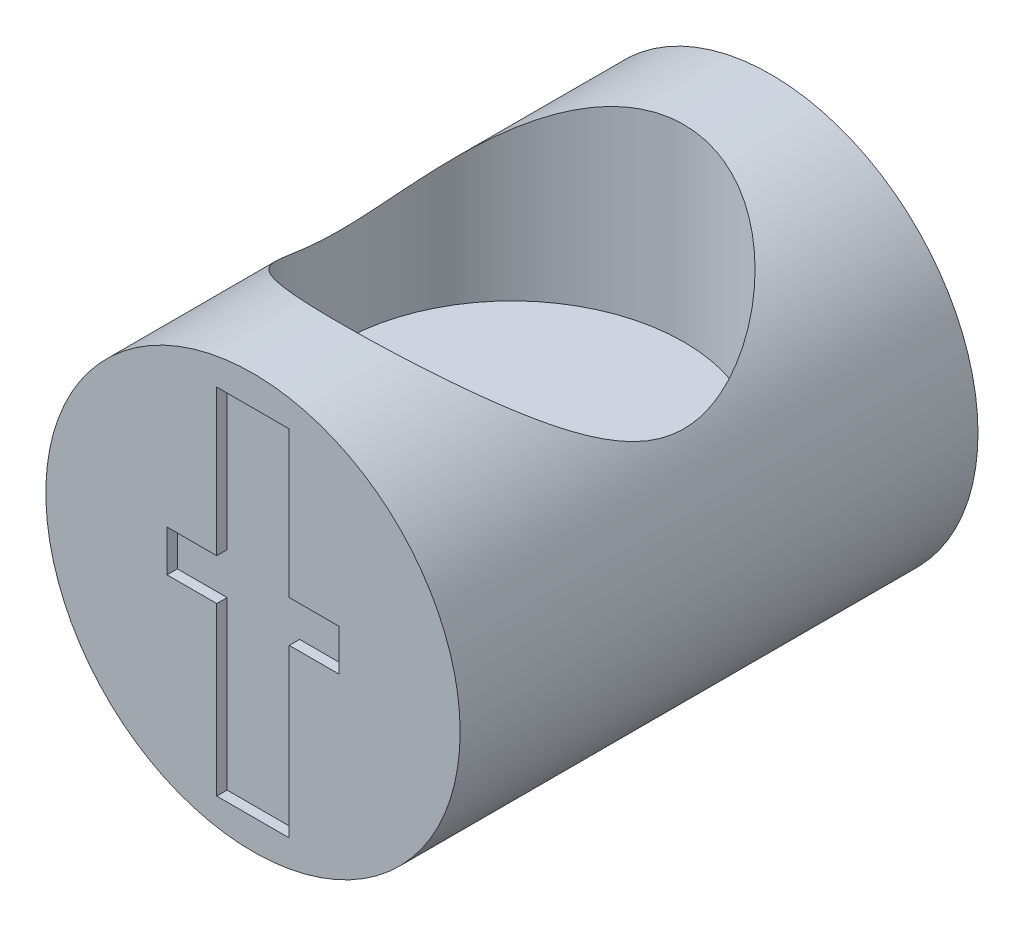
ISO-10303-21;
HEADER;
FILE_DESCRIPTION(('STEP AP214'),'2;1');
FILE_NAME('part.step','',(''),(''),'','','');
FILE_SCHEMA(('AUTOMOTIVE_DESIGN { 1 0 10303 214 1 1 1 1 }'));
ENDSEC;
DATA;
#1=APPLICATION_CONTEXT('core data for automotive mechanical design processes');
#2=APPLICATION_PROTOCOL_DEFINITION('international standard','automotive_design',2000,#1);
#3=PRODUCT_CONTEXT('',#1,'mechanical');
#4=PRODUCT('Part','Part','',(#3));
#5=PRODUCT_RELATED_PRODUCT_CATEGORY('part','',(#4));
#6=PRODUCT_DEFINITION_FORMATION('','',#4);
#7=PRODUCT_DEFINITION_CONTEXT('part definition',#1,'design');
#8=PRODUCT_DEFINITION('design','',#6,#7);
#9=PRODUCT_DEFINITION_SHAPE('','',#8);
#10=(LENGTH_UNIT() NAMED_UNIT(*) SI_UNIT(.MILLI.,.METRE.));
#11=(NAMED_UNIT(*) PLANE_ANGLE_UNIT() SI_UNIT($,.RADIAN.));
#12=(NAMED_UNIT(*) SI_UNIT($,.STERADIAN.) SOLID_ANGLE_UNIT());
#13=UNCERTAINTY_MEASURE_WITH_UNIT(LENGTH_MEASURE(1.E-05),#10,'distance_accuracy_value','');
#14=(GEOMETRIC_REPRESENTATION_CONTEXT(3) GLOBAL_UNCERTAINTY_ASSIGNED_CONTEXT((#13)) GLOBAL_UNIT_ASSIGNED_CONTEXT((#10,
#11,#12)) REPRESENTATION_CONTEXT('',''));
#15=CARTESIAN_POINT('',(0.,0.,0.));
#16=DIRECTION('',(0.,0.,1.));
#17=DIRECTION('',(1.,0.,0.));
#18=AXIS2_PLACEMENT_3D('',#15,#16,#17);
#19=CARTESIAN_POINT('',(0.,0.,50.));
#20=DIRECTION('',(0.,0.,-1.));
#21=DIRECTION('',(-1.,0.,0.));
#22=AXIS2_PLACEMENT_3D('',#19,#20,#21);
#23=CYLINDRICAL_SURFACE('',#22,20.);
#24=CARTESIAN_POINT('',(0.,0.,0.));
#25=DIRECTION('',(0.,0.,1.));
#26=DIRECTION('',(1.,0.,0.));
#27=AXIS2_PLACEMENT_3D('',#24,#25,#26);
#28=CIRCLE('',#27,20.);
#29=CARTESIAN_POINT('',(20.,0.,0.));
#30=VERTEX_POINT('',#29);
#31=EDGE_CURVE('E47',#30,#30,#28,.T.);
#32=ORIENTED_EDGE('',*,*,#31,.T.);
#33=EDGE_LOOP('',(#32));
#34=FACE_BOUND('',#33,.T.);
#35=CARTESIAN_POINT('',(0.,0.,50.));
#36=DIRECTION('',(0.,0.,1.));
#37=DIRECTION('',(1.,0.,0.));
#38=AXIS2_PLACEMENT_3D('',#35,#36,#37);
#39=CIRCLE('',#38,20.);
#40=CARTESIAN_POINT('',(20.,0.,50.));
#41=VERTEX_POINT('',#40);
#42=EDGE_CURVE('E12',#41,#41,#39,.T.);
#43=ORIENTED_EDGE('',*,*,#42,.F.);
#44=EDGE_LOOP('',(#43));
#45=FACE_BOUND('',#44,.T.);
#46=CARTESIAN_POINT('',(0.,20.,8.4));
#47=CARTESIAN_POINT('',(-0.394698975178942,19.9999966452955,8.40000344858247));
#48=CARTESIAN_POINT('',(-0.789456896835808,19.9882896222115,8.41410314964542));
#49=CARTESIAN_POINT('',(-1.57564079967477,19.9417280702438,8.47024627668804));
#50=CARTESIAN_POINT('',(-1.96706609388417,19.906868880539,8.51229532922352));
#51=CARTESIAN_POINT('',(-2.74367709559666,19.8147738184122,8.6236072588081));
#52=CARTESIAN_POINT('',(-3.12885736798368,19.7575194407535,8.69289264158653));
#53=CARTESIAN_POINT('',(-3.88978006494809,19.6219006741202,8.85747363807984));
#54=CARTESIAN_POINT('',(-4.2655227496847,19.5435368677538,8.95276853394791));
#55=CARTESIAN_POINT('',(-5.00291695065156,19.367850034973,9.1672058879828));
#56=CARTESIAN_POINT('',(-5.36464088457492,19.2706465054858,9.28619816247414));
#57=CARTESIAN_POINT('',(-6.07454277499892,19.0587818388318,9.54675069048557));
#58=CARTESIAN_POINT('',(-6.4227209251517,18.9441209513527,9.68831062122817));
#59=CARTESIAN_POINT('',(-7.1041479495527,18.6992558693516,9.9923256247644));
#60=CARTESIAN_POINT('',(-7.43739621930377,18.5690510462508,10.1547815425883));
#61=CARTESIAN_POINT('',(-8.08799902961266,18.2950521218716,10.4989733417761));
#62=CARTESIAN_POINT('',(-8.40535018510503,18.1512551449972,10.6807133039305));
#63=CARTESIAN_POINT('',(-9.13648703831569,17.7973145066341,11.1316731189351));
#64=CARTESIAN_POINT('',(-9.54311598559062,17.5821334531887,11.4085853208185));
#65=CARTESIAN_POINT('',(-10.324527144532,17.1349625737068,11.9922275382119));
#66=CARTESIAN_POINT('',(-10.6992985482179,16.9029670922738,12.2989675980436));
#67=CARTESIAN_POINT('',(-11.4174814756029,16.4264199766707,12.9404176494795));
#68=CARTESIAN_POINT('',(-11.7608111044915,16.1818380072213,13.2751965650625));
#69=CARTESIAN_POINT('',(-12.4149233254186,15.6856040738851,13.970158529579));
#70=CARTESIAN_POINT('',(-12.725709975507,15.4339529964785,14.3303384016634));
#71=CARTESIAN_POINT('',(-13.3200885765811,14.9241830683603,15.0818872243909));
#72=CARTESIAN_POINT('',(-13.6030854602694,14.6660296650628,15.47370318306));
#73=CARTESIAN_POINT('',(-14.1351355630712,14.1539476860419,16.2826377947297));
#74=CARTESIAN_POINT('',(-14.384177436292,13.9000205472644,16.6997648383487));
#75=CARTESIAN_POINT('',(-14.8467527251474,13.4047908015893,17.5588018456537));
#76=CARTESIAN_POINT('',(-15.0603711353158,13.1634589568698,18.0006489833835));
#77=CARTESIAN_POINT('',(-15.4509004794417,12.7027797493219,18.9111003755087));
#78=CARTESIAN_POINT('',(-15.6278428086437,12.4834136673457,19.3796813034977));
#79=CARTESIAN_POINT('',(-15.8711702504126,12.1706970339188,20.1272522082387));
#80=CARTESIAN_POINT('',(-15.9514674651853,12.065072599039,20.3966331860104));
#81=CARTESIAN_POINT('',(-16.0992947385688,11.8670949201531,20.9437685462009));
#82=CARTESIAN_POINT('',(-16.1668231498086,11.774743388923,21.2215240037034));
#83=CARTESIAN_POINT('',(-16.288097348558,11.6064057566701,21.7843258788794));
#84=CARTESIAN_POINT('',(-16.3418701359091,11.5303876437643,22.0693567870689));
#85=CARTESIAN_POINT('',(-16.4348497840015,11.3974694594378,22.6460778238326));
#86=CARTESIAN_POINT('',(-16.474064295884,11.3405593472634,22.9377643687135));
#87=CARTESIAN_POINT('',(-16.5374880628783,11.2478760164267,23.5298959865168));
#88=CARTESIAN_POINT('',(-16.5615052808192,11.2123735644049,23.8304048099599));
#89=CARTESIAN_POINT('',(-16.5931065604945,11.1655555991343,24.4341662355413));
#90=CARTESIAN_POINT('',(-16.6006920666786,11.1542379598912,24.7374185941522));
#91=CARTESIAN_POINT('',(-16.5992085305302,11.1564455871342,25.3438238564076));
#92=CARTESIAN_POINT('',(-16.5901377585454,11.1699734336718,25.6469767464534));
#93=CARTESIAN_POINT('',(-16.5556062846334,11.2210884432127,26.2502980980598));
#94=CARTESIAN_POINT('',(-16.5301435297562,11.2586786198055,26.5504661810178));
#95=CARTESIAN_POINT('',(-16.4604450708369,11.3603640236142,27.1726801363264));
#96=CARTESIAN_POINT('',(-16.4147019784234,11.4265737035129,27.4942080687945));
#97=CARTESIAN_POINT('',(-16.3056788050547,11.5816135650179,28.1286632094567));
#98=CARTESIAN_POINT('',(-16.2423958314527,11.6704474775772,28.4415889896339));
#99=CARTESIAN_POINT('',(-16.0993601883099,11.8669869085656,29.0584655702652));
#100=CARTESIAN_POINT('',(-16.0195644583316,11.9747416534152,29.3623904816459));
#101=CARTESIAN_POINT('',(-15.8447071081248,12.2051714474301,29.9600661455018));
#102=CARTESIAN_POINT('',(-15.7496395530383,12.3278522925843,30.2538128884175));
#103=CARTESIAN_POINT('',(-15.4858937915915,12.6591512677654,30.9984337036137));
#104=CARTESIAN_POINT('',(-15.3064866099024,12.8763670559824,31.4417029896371));
#105=CARTESIAN_POINT('',(-14.9143774562329,13.3285823867856,32.3038190167309));
#106=CARTESIAN_POINT('',(-14.7016563866963,13.5635920897677,32.7226515589624));
#107=CARTESIAN_POINT('',(-14.2440404064059,14.0434113232034,33.5373188400374));
#108=CARTESIAN_POINT('',(-13.9991027814053,14.2882335585857,33.9331220225433));
#109=CARTESIAN_POINT('',(-13.4780009593977,14.7808009978415,34.7014901291365));
#110=CARTESIAN_POINT('',(-13.2018429153143,15.0285456171811,35.0740596097446));
#111=CARTESIAN_POINT('',(-12.6041241474354,15.5337255427375,35.8135583168986));
#112=CARTESIAN_POINT('',(-12.2809985427826,15.7910382939333,36.1793092341155));
#113=CARTESIAN_POINT('',(-11.6005531108339,16.2974563832508,36.8838971910137));
#114=CARTESIAN_POINT('',(-11.2432281760522,16.5465604879641,37.2227301967784));
#115=CARTESIAN_POINT('',(-10.4952493751045,17.0307919149643,37.870667236314));
#116=CARTESIAN_POINT('',(-10.1046614013938,17.265945373265,38.1798275786088));
#117=CARTESIAN_POINT('',(-9.2900878421043,17.7175321823896,38.7661127818517));
#118=CARTESIAN_POINT('',(-8.8661141617731,17.9339721491455,39.0432489763121));
#119=CARTESIAN_POINT('',(-8.0966615998196,18.2914205342511,39.4965603183188));
#120=CARTESIAN_POINT('',(-7.75824795778765,18.437712303454,39.680600705969));
#121=CARTESIAN_POINT('',(-7.06428773000994,18.7145747838767,40.0268467746843));
#122=CARTESIAN_POINT('',(-6.70874525801631,18.8451492437545,40.1890576632893));
#123=CARTESIAN_POINT('',(-5.98192839077866,19.0883030427185,40.4897102776646));
#124=CARTESIAN_POINT('',(-5.61065976667816,19.2008889120588,40.6281606303911));
#125=CARTESIAN_POINT('',(-4.85410153741345,19.4059598436715,40.879437990384));
#126=CARTESIAN_POINT('',(-4.46881168877932,19.4984445567051,40.9922645524626));
#127=CARTESIAN_POINT('',(-3.68370789405272,19.6619491195484,41.1912161961806));
#128=CARTESIAN_POINT('',(-3.28380693393771,19.7328034177983,41.2771354619225));
#129=CARTESIAN_POINT('',(-2.47527956295057,19.8504370094547,41.4195451451607));
#130=CARTESIAN_POINT('',(-2.06665313830461,19.897216264854,41.4760355161978));
#131=CARTESIAN_POINT('',(-1.24441650480821,19.9655084019545,41.558443711741));
#132=CARTESIAN_POINT('',(-0.830808746741599,19.9870332337292,41.5843759959723));
#133=CARTESIAN_POINT('',(-0.00229538460336004,20.0042900441552,41.6051696097669));
#134=CARTESIAN_POINT('',(0.412610084210983,20.0000246268366,41.6000340762341));
#135=CARTESIAN_POINT('',(1.19195573041446,19.967807858522,41.561202911586));
#136=CARTESIAN_POINT('',(1.5566874494046,19.9426503610818,41.5308759598272));
#137=CARTESIAN_POINT('',(2.28146982597581,19.8727806768232,41.4465185511675));
#138=CARTESIAN_POINT('',(2.64152091349246,19.8280702992752,41.392490287399));
#139=CARTESIAN_POINT('',(3.35458568211295,19.7199600654026,41.2615554913025));
#140=CARTESIAN_POINT('',(3.70759890731723,19.656559002503,41.1846474819722));
#141=CARTESIAN_POINT('',(4.40449517307662,19.5122286942472,41.0090464600545));
#142=CARTESIAN_POINT('',(4.74837774868425,19.4312985581964,40.9103523404573));
#143=CARTESIAN_POINT('',(5.43172944764431,19.2515847700464,40.6903670191165));
#144=CARTESIAN_POINT('',(5.77098872020586,19.1524895540864,40.5686801082442));
#145=CARTESIAN_POINT('',(6.43674143192144,18.9391279559672,40.3054405194323));
#146=CARTESIAN_POINT('',(6.76323509227053,18.8248618368314,40.1638881859043));
#147=CARTESIAN_POINT('',(7.40242695050028,18.5828114257006,39.8623340030078));
#148=CARTESIAN_POINT('',(7.71512331243304,18.4550253423025,39.7023297084904));
#149=CARTESIAN_POINT('',(8.32594563381835,18.1876288612729,39.3652485717753));
#150=CARTESIAN_POINT('',(8.62406866021638,18.0480160987099,39.1881683139845));
#151=CARTESIAN_POINT('',(9.33631559156132,17.6933601482723,38.7347385018059));
#152=CARTESIAN_POINT('',(9.74211191124159,17.4726970173606,38.4496389549776));
#153=CARTESIAN_POINT('',(10.5210805171552,17.0150259100496,37.849468116245));
#154=CARTESIAN_POINT('',(10.8942401050414,16.7780116353165,37.5343852570716));
#155=CARTESIAN_POINT('',(11.6086373974721,16.2919219229195,36.8758688651232));
#156=CARTESIAN_POINT('',(11.9497751747551,16.042812184949,36.5323524942863));
#157=CARTESIAN_POINT('',(12.5987479391492,15.5383532930442,35.8196052034116));
#158=CARTESIAN_POINT('',(12.9065877507607,15.283005049589,35.4503780213579));
#159=CARTESIAN_POINT('',(13.4941094832925,14.7670071037832,34.68027670398));
#160=CARTESIAN_POINT('',(13.7731967723363,14.5063435439594,34.2789581907265));
#161=CARTESIAN_POINT('',(14.2965626470142,13.9908248458607,33.4503566921983));
#162=CARTESIAN_POINT('',(14.5408276617343,13.7359720044627,33.0230636761899));
#163=CARTESIAN_POINT('',(14.9926268634756,13.2413344807694,32.1431838965802));
#164=CARTESIAN_POINT('',(15.2002719299633,13.0015057810003,31.6906791432905));
#165=CARTESIAN_POINT('',(15.5774543224708,12.5471060621683,30.7580785210586));
#166=CARTESIAN_POINT('',(15.7470300796134,12.3325096761905,30.2780110973235));
#167=CARTESIAN_POINT('',(15.9750512441224,12.0339090979649,29.52033648862));
#168=CARTESIAN_POINT('',(16.0484335287304,11.9356875134222,29.2527652400832));
#169=CARTESIAN_POINT('',(16.182572795463,11.7531755100396,28.7097865705206));
#170=CARTESIAN_POINT('',(16.2433316006212,11.6688830799661,28.4343802875401));
#171=CARTESIAN_POINT('',(16.3512560663958,11.5171656287826,27.8769472494994));
#172=CARTESIAN_POINT('',(16.3984502841117,11.4497052118771,27.5949357750476));
#173=CARTESIAN_POINT('',(16.4785365523849,11.3341429406444,27.0249924253388));
#174=CARTESIAN_POINT('',(16.511432214988,11.2860361974959,26.7370620645583));
#175=CARTESIAN_POINT('',(16.5624528955225,11.2110330456974,26.1539814371535));
#176=CARTESIAN_POINT('',(16.5804177157702,11.1843667751359,25.8587869962432));
#177=CARTESIAN_POINT('',(16.6005005101624,11.1545379805242,25.2666754357459));
#178=CARTESIAN_POINT('',(16.602619530299,11.151373905078,24.9697584311614));
#179=CARTESIAN_POINT('',(16.5909487327652,11.1687297227833,24.3767693066185));
#180=CARTESIAN_POINT('',(16.5771497159342,11.189263311007,24.0806977744335));
#181=CARTESIAN_POINT('',(16.5340102231995,11.2529087668619,23.4921459677016));
#182=CARTESIAN_POINT('',(16.5046674942053,11.2960239077217,23.199666220081));
#183=CARTESIAN_POINT('',(16.4257496288291,11.4105327655461,22.57783864895));
#184=CARTESIAN_POINT('',(16.3738359218532,11.4851497061378,22.2493849604407));
#185=CARTESIAN_POINT('',(16.2518374557661,11.6571370574015,21.602002456089));
#186=CARTESIAN_POINT('',(16.1817486532031,11.754512530736,21.2830757773702));
#187=CARTESIAN_POINT('',(16.0245371718655,11.9679484146517,20.6549670053178));
#188=CARTESIAN_POINT('',(15.9373709504998,12.0840564515218,20.3458122180959));
#189=CARTESIAN_POINT('',(15.7472483260178,12.330793565144,19.738296428837));
#190=CARTESIAN_POINT('',(15.6442858590076,12.4614282130781,19.4399396265438));
#191=CARTESIAN_POINT('',(15.3594114039098,12.812687481983,18.6838705554844));
#192=CARTESIAN_POINT('',(15.1663575756821,13.0415420838561,18.2341560973505));
#193=CARTESIAN_POINT('',(14.7454983158529,13.5155827107875,17.3602589708177));
#194=CARTESIAN_POINT('',(14.5176734799581,13.7607778115065,16.9360907442194));
#195=CARTESIAN_POINT('',(14.0282495241585,14.2593984929394,16.1119099623764));
#196=CARTESIAN_POINT('',(13.766606674946,14.512834406432,15.7119296845234));
#197=CARTESIAN_POINT('',(13.210395505564,15.0208980594888,14.9365496161379));
#198=CARTESIAN_POINT('',(12.9158336863865,15.2755255542509,14.5611449954298));
#199=CARTESIAN_POINT('',(12.2809719715334,15.7908752702281,13.820312661746));
#200=CARTESIAN_POINT('',(11.9392822138208,16.0514125669414,13.4559436798966));
#201=CARTESIAN_POINT('',(11.2202800771209,16.5619999277011,12.7559358709636));
#202=CARTESIAN_POINT('',(10.8429617720012,16.8120482370788,12.4203018411582));
#203=CARTESIAN_POINT('',(10.053652082582,17.2955979861789,11.781025107175));
#204=CARTESIAN_POINT('',(9.64173446698326,17.5291327685408,11.4773172993957));
#205=CARTESIAN_POINT('',(8.99822815709248,17.8630997276374,11.0479977624389));
#206=CARTESIAN_POINT('',(8.77948476596258,17.9716863445845,10.9092814142434));
#207=CARTESIAN_POINT('',(8.33350403545557,18.1827824563872,10.6410153485498));
#208=CARTESIAN_POINT('',(8.10626468836991,18.285290499804,10.5114678189598));
#209=CARTESIAN_POINT('',(7.54306598052021,18.5265333384429,10.2079676392106));
#210=CARTESIAN_POINT('',(7.20275136534879,18.661666252225,10.0391652290448));
#211=CARTESIAN_POINT('',(6.50637097178844,18.9157200959421,9.72344128604715));
#212=CARTESIAN_POINT('',(6.15030905323539,19.0346449697937,9.57651442941045));
#213=CARTESIAN_POINT('',(5.42429798603642,19.2541062785101,9.30647298638667));
#214=CARTESIAN_POINT('',(5.05436729616162,19.3546661775928,9.18332800308948));
#215=CARTESIAN_POINT('',(4.30221136208994,19.535620988391,8.96240327433902));
#216=CARTESIAN_POINT('',(3.91998864835085,19.616020020855,8.86461834531738));
#217=CARTESIAN_POINT('',(3.24594576205722,19.7369935382418,8.71779633995303));
#218=CARTESIAN_POINT('',(2.95630983659309,19.7824900232818,8.66269236156212));
#219=CARTESIAN_POINT('',(2.3727871498738,19.8609296740836,8.56779855907284));
#220=CARTESIAN_POINT('',(2.07889972130268,19.8938708464787,8.5280111667297));
#221=CARTESIAN_POINT('',(1.48820811515359,19.9467584367588,8.46417549030524));
#222=CARTESIAN_POINT('',(1.19140350731088,19.9667029076095,8.44012956444861));
#223=CARTESIAN_POINT('',(0.5964102927649,19.9933236415208,8.40804210273354));
#224=CARTESIAN_POINT('',(0.298221972160024,20.0000025347079,8.39999739436095));
#225=CARTESIAN_POINT('',(0.,20.,8.4));
#226=B_SPLINE_CURVE_WITH_KNOTS('',3,(#46,#47,#48,#49,#50,#51,#52,#53,#54,#55,#56,#57,#58,#59,
#60,#61,#62,#63,#64,#65,#66,#67,#68,#69,#70,#71,#72,#73,#74,#75,#76,#77,#78,#79,#80,#81,#82,#83,
#84,#85,#86,#87,#88,#89,#90,#91,#92,#93,#94,#95,#96,#97,#98,#99,#100,#101,#102,#103,#104,#105,
#106,#107,#108,#109,#110,#111,#112,#113,#114,#115,#116,#117,#118,#119,#120,#121,#122,#123,#124,
#125,#126,#127,#128,#129,#130,#131,#132,#133,#134,#135,#136,#137,#138,#139,#140,#141,#142,#143,
#144,#145,#146,#147,#148,#149,#150,#151,#152,#153,#154,#155,#156,#157,#158,#159,#160,#161,#162,
#163,#164,#165,#166,#167,#168,#169,#170,#171,#172,#173,#174,#175,#176,#177,#178,#179,#180,#181,
#182,#183,#184,#185,#186,#187,#188,#189,#190,#191,#192,#193,#194,#195,#196,#197,#198,#199,#200,
#201,#202,#203,#204,#205,#206,#207,#208,#209,#210,#211,#212,#213,#214,#215,#216,#217,#218,#219,
#220,#221,#222,#223,#224,#225),.UNSPECIFIED.,.T.,.F.,(4,2,2,2,2,2,2,2,2,2,2,2,2,2,2,2,2,2,2,2,2,
2,2,2,2,2,2,2,2,2,2,2,2,2,2,2,2,2,2,2,2,2,2,2,2,2,2,2,2,2,2,2,2,2,2,2,2,2,2,2,2,2,2,2,2,2,2,2,2,
2,2,2,2,2,2,2,2,2,2,2,2,2,2,2,2,2,2,2,2,4),(0.,1.18377821646862,2.36779481457974,
3.55279184433443,4.73775617219572,5.91543690634163,7.09310079803276,8.27081232923986,
9.44877358063308,11.0573540075558,12.6664780009031,14.2796805986125,15.892681792748,
17.5349213639497,19.1777083432354,20.8164947499058,22.4538724853993,23.3541673006508,
24.2545781885762,25.1532079294993,26.0513647223015,26.960655419397,27.8698661809379,
28.7791713637815,29.6885904511751,30.6814047157584,31.6743828110731,32.669983691509,
33.665972417394,35.2392124928611,36.8133577694393,38.389611566972,39.9655552560079,
41.6189963313798,43.2726847257351,44.9231702285064,46.5730698152261,47.8081495575917,
49.0429341410323,50.2772694470127,51.5116261967013,52.7552062009203,53.9987881683716,
55.2417814509531,56.4846492311462,57.583903996514,58.6830570669664,59.7822811086602,
60.8815610176911,62.0018435644761,63.1221066910505,64.2425184394781,65.363154763244,
66.9892380806723,68.6159512882408,70.247582872212,71.8789777335772,73.5392396819486,
75.2001469079799,76.8559354413715,78.5100448569611,79.3924429228538,80.2747134675612,
81.1551127579978,82.0352895159328,82.9247923175245,83.8142364019034,84.7041947607424,
85.5942821560406,86.615095381729,87.6361359050222,88.6598144933648,89.6838870413173,
91.3022327486835,92.9214849141376,94.5428522464839,96.1638999475773,97.8521481489541,
99.5406776546793,101.225694261199,102.067981720174,102.910469496925,104.118856932032,
105.326949802175,106.533488172123,107.739779732186,108.634106330418,109.528574858929,
110.423177356875,111.317602466936),.UNSPECIFIED.);
#227=CARTESIAN_POINT('',(0.,20.,8.4));
#228=VERTEX_POINT('',#227);
#229=EDGE_CURVE('E39',#228,#228,#226,.T.);
#230=ORIENTED_EDGE('',*,*,#229,.F.);
#231=EDGE_LOOP('',(#230));
#232=FACE_BOUND('',#231,.T.);
#233=ADVANCED_FACE('F35',(#34,#45,#232),#23,.T.);
#234=CARTESIAN_POINT('',(0.,0.,50.));
#235=DIRECTION('',(0.,0.,1.));
#236=DIRECTION('',(1.,0.,0.));
#237=AXIS2_PLACEMENT_3D('',#234,#235,#236);
#238=PLANE('',#237);
#239=DIRECTION('',(0.,1.,0.));
#240=VECTOR('',#239,1.);
#241=CARTESIAN_POINT('',(8.3,1.,50.));
#242=LINE('',#241,#240);
#243=CARTESIAN_POINT('',(8.3,-1.,50.));
#244=VERTEX_POINT('',#243);
#245=CARTESIAN_POINT('',(8.3,3.,50.));
#246=VERTEX_POINT('',#245);
#247=EDGE_CURVE('E193',#244,#246,#242,.T.);
#248=ORIENTED_EDGE('',*,*,#247,.F.);
#249=DIRECTION('',(1.,0.,0.));
#250=VECTOR('',#249,1.);
#251=CARTESIAN_POINT('',(3.5,-1.,50.));
#252=LINE('',#251,#250);
#253=CARTESIAN_POINT('',(3.5,-1.,50.));
#254=VERTEX_POINT('',#253);
#255=EDGE_CURVE('E191',#254,#244,#252,.T.);
#256=ORIENTED_EDGE('',*,*,#255,.F.);
#257=DIRECTION('',(0.,1.,0.));
#258=VECTOR('',#257,1.);
#259=CARTESIAN_POINT('',(3.5,-2.,50.));
#260=LINE('',#259,#258);
#261=CARTESIAN_POINT('',(3.5,-17.1,50.));
#262=VERTEX_POINT('',#261);
#263=EDGE_CURVE('E189',#262,#254,#260,.T.);
#264=ORIENTED_EDGE('',*,*,#263,.F.);
#265=DIRECTION('',(1.,0.,0.));
#266=VECTOR('',#265,1.);
#267=CARTESIAN_POINT('',(-3.5,-17.1,50.));
#268=LINE('',#267,#266);
#269=CARTESIAN_POINT('',(-3.5,-17.1,50.));
#270=VERTEX_POINT('',#269);
#271=EDGE_CURVE('E138',#270,#262,#268,.T.);
#272=ORIENTED_EDGE('',*,*,#271,.F.);
#273=DIRECTION('',(0.,-1.,0.));
#274=VECTOR('',#273,1.);
#275=CARTESIAN_POINT('',(-3.5,-2.,50.));
#276=LINE('',#275,#274);
#277=CARTESIAN_POINT('',(-3.5,-1.,50.));
#278=VERTEX_POINT('',#277);
#279=EDGE_CURVE('E185',#278,#270,#276,.T.);
#280=ORIENTED_EDGE('',*,*,#279,.F.);
#281=DIRECTION('',(1.,0.,0.));
#282=VECTOR('',#281,1.);
#283=CARTESIAN_POINT('',(-8.3,-1.,50.));
#284=LINE('',#283,#282);
#285=CARTESIAN_POINT('',(-8.3,-1.,50.));
#286=VERTEX_POINT('',#285);
#287=EDGE_CURVE('E182',#286,#278,#284,.T.);
#288=ORIENTED_EDGE('',*,*,#287,.F.);
#289=DIRECTION('',(0.,-1.,0.));
#290=VECTOR('',#289,1.);
#291=CARTESIAN_POINT('',(-8.3,1.,50.));
#292=LINE('',#291,#290);
#293=CARTESIAN_POINT('',(-8.3,3.,50.));
#294=VERTEX_POINT('',#293);
#295=EDGE_CURVE('E179',#294,#286,#292,.T.);
#296=ORIENTED_EDGE('',*,*,#295,.F.);
#297=DIRECTION('',(-1.,0.,0.));
#298=VECTOR('',#297,1.);
#299=CARTESIAN_POINT('',(-8.3,3.,50.));
#300=LINE('',#299,#298);
#301=CARTESIAN_POINT('',(-3.5,3.,50.));
#302=VERTEX_POINT('',#301);
#303=EDGE_CURVE('E176',#302,#294,#300,.T.);
#304=ORIENTED_EDGE('',*,*,#303,.F.);
#305=DIRECTION('',(0.,-1.,0.));
#306=VECTOR('',#305,1.);
#307=CARTESIAN_POINT('',(-3.5,3.,50.));
#308=LINE('',#307,#306);
#309=CARTESIAN_POINT('',(-3.5,17.1,50.));
#310=VERTEX_POINT('',#309);
#311=EDGE_CURVE('E173',#310,#302,#308,.T.);
#312=ORIENTED_EDGE('',*,*,#311,.F.);
#313=DIRECTION('',(-1.,0.,0.));
#314=VECTOR('',#313,1.);
#315=CARTESIAN_POINT('',(-3.5,17.1,50.));
#316=LINE('',#315,#314);
#317=CARTESIAN_POINT('',(3.5,17.1,50.));
#318=VERTEX_POINT('',#317);
#319=EDGE_CURVE('E170',#318,#310,#316,.T.);
#320=ORIENTED_EDGE('',*,*,#319,.F.);
#321=DIRECTION('',(0.,1.,0.));
#322=VECTOR('',#321,1.);
#323=CARTESIAN_POINT('',(3.5,17.1,50.));
#324=LINE('',#323,#322);
#325=CARTESIAN_POINT('',(3.5,3.,50.));
#326=VERTEX_POINT('',#325);
#327=EDGE_CURVE('E166',#326,#318,#324,.T.);
#328=ORIENTED_EDGE('',*,*,#327,.F.);
#329=DIRECTION('',(-1.,0.,0.));
#330=VECTOR('',#329,1.);
#331=CARTESIAN_POINT('',(8.3,3.,50.));
#332=LINE('',#331,#330);
#333=EDGE_CURVE('E164',#246,#326,#332,.T.);
#334=ORIENTED_EDGE('',*,*,#333,.F.);
#335=EDGE_LOOP('',(#248,#256,#264,#272,#280,#288,#296,#304,#312,#320,#328,#334));
#336=FACE_BOUND('',#335,.T.);
#337=ORIENTED_EDGE('',*,*,#42,.T.);
#338=EDGE_LOOP('',(#337));
#339=FACE_BOUND('',#338,.T.);
#340=ADVANCED_FACE('F222',(#336,#339),#238,.T.);
#341=CARTESIAN_POINT('',(0.,0.,0.));
#342=DIRECTION('',(0.,0.,1.));
#343=DIRECTION('',(1.,0.,0.));
#344=AXIS2_PLACEMENT_3D('',#341,#342,#343);
#345=PLANE('',#344);
#346=ORIENTED_EDGE('',*,*,#31,.F.);
#347=EDGE_LOOP('',(#346));
#348=FACE_BOUND('',#347,.T.);
#349=ADVANCED_FACE('F226',(#348),#345,.F.);
#350=CARTESIAN_POINT('',(0.,20.0203185392076,25.));
#351=DIRECTION('',(0.,-1.,0.));
#352=DIRECTION('',(0.,0.,-1.));
#353=AXIS2_PLACEMENT_3D('',#350,#351,#352);
#354=CYLINDRICAL_SURFACE('',#353,16.6);
#355=ORIENTED_EDGE('',*,*,#229,.T.);
#356=EDGE_LOOP('',(#355));
#357=FACE_BOUND('',#356,.T.);
#358=CARTESIAN_POINT('',(0.,1.82031853920763,25.));
#359=DIRECTION('',(0.,1.,0.));
#360=DIRECTION('',(0.,0.,1.));
#361=AXIS2_PLACEMENT_3D('',#358,#359,#360);
#362=CIRCLE('',#361,16.6);
#363=CARTESIAN_POINT('',(0.,1.82031853920763,41.6));
#364=VERTEX_POINT('',#363);
#365=EDGE_CURVE('E167',#364,#364,#362,.T.);
#366=ORIENTED_EDGE('',*,*,#365,.F.);
#367=EDGE_LOOP('',(#366));
#368=FACE_BOUND('',#367,.T.);
#369=ADVANCED_FACE('F218',(#357,#368),#354,.F.);
#370=CARTESIAN_POINT('',(8.3,1.,49.));
#371=DIRECTION('',(1.,0.,0.));
#372=DIRECTION('',(0.,1.,0.));
#373=AXIS2_PLACEMENT_3D('',#370,#371,#372);
#374=PLANE('',#373);
#375=ORIENTED_EDGE('',*,*,#247,.T.);
#376=DIRECTION('',(0.,0.,1.));
#377=VECTOR('',#376,1.);
#378=CARTESIAN_POINT('',(8.3,3.,49.));
#379=LINE('',#378,#377);
#380=CARTESIAN_POINT('',(8.3,3.,49.));
#381=VERTEX_POINT('',#380);
#382=EDGE_CURVE('E55',#381,#246,#379,.T.);
#383=ORIENTED_EDGE('',*,*,#382,.F.);
#384=DIRECTION('',(0.,1.,0.));
#385=VECTOR('',#384,1.);
#386=CARTESIAN_POINT('',(8.3,1.,49.));
#387=LINE('',#386,#385);
#388=CARTESIAN_POINT('',(8.3,-1.,49.));
#389=VERTEX_POINT('',#388);
#390=EDGE_CURVE('E63',#389,#381,#387,.T.);
#391=ORIENTED_EDGE('',*,*,#390,.F.);
#392=DIRECTION('',(0.,0.,1.));
#393=VECTOR('',#392,1.);
#394=CARTESIAN_POINT('',(8.3,-1.,49.));
#395=LINE('',#394,#393);
#396=EDGE_CURVE('E101',#389,#244,#395,.T.);
#397=ORIENTED_EDGE('',*,*,#396,.T.);
#398=EDGE_LOOP('',(#375,#383,#391,#397));
#399=FACE_BOUND('',#398,.T.);
#400=ADVANCED_FACE('F240',(#399),#374,.F.);
#401=CARTESIAN_POINT('',(3.5,-1.,49.));
#402=DIRECTION('',(0.,-1.,0.));
#403=DIRECTION('',(0.,0.,-1.));
#404=AXIS2_PLACEMENT_3D('',#401,#402,#403);
#405=PLANE('',#404);
#406=ORIENTED_EDGE('',*,*,#255,.T.);
#407=ORIENTED_EDGE('',*,*,#396,.F.);
#408=DIRECTION('',(1.,0.,0.));
#409=VECTOR('',#408,1.);
#410=CARTESIAN_POINT('',(3.5,-1.,49.));
#411=LINE('',#410,#409);
#412=CARTESIAN_POINT('',(3.5,-1.,49.));
#413=VERTEX_POINT('',#412);
#414=EDGE_CURVE('E151',#413,#389,#411,.T.);
#415=ORIENTED_EDGE('',*,*,#414,.F.);
#416=DIRECTION('',(0.,0.,1.));
#417=VECTOR('',#416,1.);
#418=CARTESIAN_POINT('',(3.5,-1.,49.));
#419=LINE('',#418,#417);
#420=EDGE_CURVE('E142',#413,#254,#419,.T.);
#421=ORIENTED_EDGE('',*,*,#420,.T.);
#422=EDGE_LOOP('',(#406,#407,#415,#421));
#423=FACE_BOUND('',#422,.T.);
#424=ADVANCED_FACE('F276',(#423),#405,.F.);
#425=CARTESIAN_POINT('',(3.5,-2.,49.));
#426=DIRECTION('',(1.,0.,0.));
#427=DIRECTION('',(0.,0.,-1.));
#428=AXIS2_PLACEMENT_3D('',#425,#426,#427);
#429=PLANE('',#428);
#430=ORIENTED_EDGE('',*,*,#263,.T.);
#431=ORIENTED_EDGE('',*,*,#420,.F.);
#432=DIRECTION('',(0.,1.,0.));
#433=VECTOR('',#432,1.);
#434=CARTESIAN_POINT('',(3.5,-17.1,49.));
#435=LINE('',#434,#433);
#436=CARTESIAN_POINT('',(3.5,-17.1,49.));
#437=VERTEX_POINT('',#436);
#438=EDGE_CURVE('E146',#437,#413,#435,.T.);
#439=ORIENTED_EDGE('',*,*,#438,.F.);
#440=DIRECTION('',(0.,0.,1.));
#441=VECTOR('',#440,1.);
#442=CARTESIAN_POINT('',(3.5,-17.1,49.));
#443=LINE('',#442,#441);
#444=EDGE_CURVE('E132',#437,#262,#443,.T.);
#445=ORIENTED_EDGE('',*,*,#444,.T.);
#446=EDGE_LOOP('',(#430,#431,#439,#445));
#447=FACE_BOUND('',#446,.T.);
#448=ADVANCED_FACE('F147',(#447),#429,.F.);
#449=CARTESIAN_POINT('',(-3.5,-17.1,49.));
#450=DIRECTION('',(0.,-1.,0.));
#451=DIRECTION('',(0.,0.,-1.));
#452=AXIS2_PLACEMENT_3D('',#449,#450,#451);
#453=PLANE('',#452);
#454=ORIENTED_EDGE('',*,*,#271,.T.);
#455=ORIENTED_EDGE('',*,*,#444,.F.);
#456=DIRECTION('',(1.,0.,0.));
#457=VECTOR('',#456,1.);
#458=CARTESIAN_POINT('',(-3.5,-17.1,49.));
#459=LINE('',#458,#457);
#460=CARTESIAN_POINT('',(-3.5,-17.1,49.));
#461=VERTEX_POINT('',#460);
#462=EDGE_CURVE('E136',#461,#437,#459,.T.);
#463=ORIENTED_EDGE('',*,*,#462,.F.);
#464=DIRECTION('',(0.,0.,1.));
#465=VECTOR('',#464,1.);
#466=CARTESIAN_POINT('',(-3.5,-17.1,49.));
#467=LINE('',#466,#465);
#468=EDGE_CURVE('E143',#461,#270,#467,.T.);
#469=ORIENTED_EDGE('',*,*,#468,.T.);
#470=EDGE_LOOP('',(#454,#455,#463,#469));
#471=FACE_BOUND('',#470,.T.);
#472=ADVANCED_FACE('F134',(#471),#453,.F.);
#473=CARTESIAN_POINT('',(-3.5,-2.,49.));
#474=DIRECTION('',(-1.,0.,0.));
#475=DIRECTION('',(0.,0.,1.));
#476=AXIS2_PLACEMENT_3D('',#473,#474,#475);
#477=PLANE('',#476);
#478=ORIENTED_EDGE('',*,*,#279,.T.);
#479=ORIENTED_EDGE('',*,*,#468,.F.);
#480=DIRECTION('',(0.,-1.,0.));
#481=VECTOR('',#480,1.);
#482=CARTESIAN_POINT('',(-3.5,-2.,49.));
#483=LINE('',#482,#481);
#484=CARTESIAN_POINT('',(-3.5,-1.,49.));
#485=VERTEX_POINT('',#484);
#486=EDGE_CURVE('E156',#485,#461,#483,.T.);
#487=ORIENTED_EDGE('',*,*,#486,.F.);
#488=DIRECTION('',(0.,0.,1.));
#489=VECTOR('',#488,1.);
#490=CARTESIAN_POINT('',(-3.5,-1.,49.));
#491=LINE('',#490,#489);
#492=EDGE_CURVE('E198',#485,#278,#491,.T.);
#493=ORIENTED_EDGE('',*,*,#492,.T.);
#494=EDGE_LOOP('',(#478,#479,#487,#493));
#495=FACE_BOUND('',#494,.T.);
#496=ADVANCED_FACE('F267',(#495),#477,.F.);
#497=CARTESIAN_POINT('',(-8.3,-1.,49.));
#498=DIRECTION('',(0.,-1.,0.));
#499=DIRECTION('',(0.,0.,-1.));
#500=AXIS2_PLACEMENT_3D('',#497,#498,#499);
#501=PLANE('',#500);
#502=ORIENTED_EDGE('',*,*,#287,.T.);
#503=ORIENTED_EDGE('',*,*,#492,.F.);
#504=DIRECTION('',(1.,0.,0.));
#505=VECTOR('',#504,1.);
#506=CARTESIAN_POINT('',(-8.3,-1.,49.));
#507=LINE('',#506,#505);
#508=CARTESIAN_POINT('',(-8.3,-1.,49.));
#509=VERTEX_POINT('',#508);
#510=EDGE_CURVE('E159',#509,#485,#507,.T.);
#511=ORIENTED_EDGE('',*,*,#510,.F.);
#512=DIRECTION('',(0.,0.,1.));
#513=VECTOR('',#512,1.);
#514=CARTESIAN_POINT('',(-8.3,-1.,49.));
#515=LINE('',#514,#513);
#516=EDGE_CURVE('E200',#509,#286,#515,.T.);
#517=ORIENTED_EDGE('',*,*,#516,.T.);
#518=EDGE_LOOP('',(#502,#503,#511,#517));
#519=FACE_BOUND('',#518,.T.);
#520=ADVANCED_FACE('F263',(#519),#501,.F.);
#521=CARTESIAN_POINT('',(-8.3,1.,49.));
#522=DIRECTION('',(-1.,0.,0.));
#523=DIRECTION('',(0.,0.,1.));
#524=AXIS2_PLACEMENT_3D('',#521,#522,#523);
#525=PLANE('',#524);
#526=ORIENTED_EDGE('',*,*,#295,.T.);
#527=ORIENTED_EDGE('',*,*,#516,.F.);
#528=DIRECTION('',(0.,-1.,0.));
#529=VECTOR('',#528,1.);
#530=CARTESIAN_POINT('',(-8.3,1.,49.));
#531=LINE('',#530,#529);
#532=CARTESIAN_POINT('',(-8.3,3.,49.));
#533=VERTEX_POINT('',#532);
#534=EDGE_CURVE('E309',#533,#509,#531,.T.);
#535=ORIENTED_EDGE('',*,*,#534,.F.);
#536=DIRECTION('',(0.,0.,1.));
#537=VECTOR('',#536,1.);
#538=CARTESIAN_POINT('',(-8.3,3.,49.));
#539=LINE('',#538,#537);
#540=EDGE_CURVE('E202',#533,#294,#539,.T.);
#541=ORIENTED_EDGE('',*,*,#540,.T.);
#542=EDGE_LOOP('',(#526,#527,#535,#541));
#543=FACE_BOUND('',#542,.T.);
#544=ADVANCED_FACE('F259',(#543),#525,.F.);
#545=CARTESIAN_POINT('',(-8.3,3.,49.));
#546=DIRECTION('',(0.,1.,0.));
#547=DIRECTION('',(0.,0.,1.));
#548=AXIS2_PLACEMENT_3D('',#545,#546,#547);
#549=PLANE('',#548);
#550=ORIENTED_EDGE('',*,*,#303,.T.);
#551=ORIENTED_EDGE('',*,*,#540,.F.);
#552=DIRECTION('',(-1.,0.,0.));
#553=VECTOR('',#552,1.);
#554=CARTESIAN_POINT('',(-8.3,3.,49.));
#555=LINE('',#554,#553);
#556=CARTESIAN_POINT('',(-3.5,3.,49.));
#557=VERTEX_POINT('',#556);
#558=EDGE_CURVE('E306',#557,#533,#555,.T.);
#559=ORIENTED_EDGE('',*,*,#558,.F.);
#560=DIRECTION('',(0.,0.,1.));
#561=VECTOR('',#560,1.);
#562=CARTESIAN_POINT('',(-3.5,3.,49.));
#563=LINE('',#562,#561);
#564=EDGE_CURVE('E204',#557,#302,#563,.T.);
#565=ORIENTED_EDGE('',*,*,#564,.T.);
#566=EDGE_LOOP('',(#550,#551,#559,#565));
#567=FACE_BOUND('',#566,.T.);
#568=ADVANCED_FACE('F255',(#567),#549,.F.);
#569=CARTESIAN_POINT('',(-3.5,3.,49.));
#570=DIRECTION('',(-1.,0.,0.));
#571=DIRECTION('',(0.,0.,1.));
#572=AXIS2_PLACEMENT_3D('',#569,#570,#571);
#573=PLANE('',#572);
#574=ORIENTED_EDGE('',*,*,#311,.T.);
#575=ORIENTED_EDGE('',*,*,#564,.F.);
#576=DIRECTION('',(0.,-1.,0.));
#577=VECTOR('',#576,1.);
#578=CARTESIAN_POINT('',(-3.5,3.,49.));
#579=LINE('',#578,#577);
#580=CARTESIAN_POINT('',(-3.5,17.1,49.));
#581=VERTEX_POINT('',#580);
#582=EDGE_CURVE('E303',#581,#557,#579,.T.);
#583=ORIENTED_EDGE('',*,*,#582,.F.);
#584=DIRECTION('',(0.,0.,1.));
#585=VECTOR('',#584,1.);
#586=CARTESIAN_POINT('',(-3.5,17.1,49.));
#587=LINE('',#586,#585);
#588=EDGE_CURVE('E206',#581,#310,#587,.T.);
#589=ORIENTED_EDGE('',*,*,#588,.T.);
#590=EDGE_LOOP('',(#574,#575,#583,#589));
#591=FACE_BOUND('',#590,.T.);
#592=ADVANCED_FACE('F251',(#591),#573,.F.);
#593=CARTESIAN_POINT('',(-3.5,17.1,49.));
#594=DIRECTION('',(0.,1.,0.));
#595=DIRECTION('',(0.,0.,1.));
#596=AXIS2_PLACEMENT_3D('',#593,#594,#595);
#597=PLANE('',#596);
#598=ORIENTED_EDGE('',*,*,#319,.T.);
#599=ORIENTED_EDGE('',*,*,#588,.F.);
#600=DIRECTION('',(-1.,0.,0.));
#601=VECTOR('',#600,1.);
#602=CARTESIAN_POINT('',(-3.5,17.1,49.));
#603=LINE('',#602,#601);
#604=CARTESIAN_POINT('',(3.5,17.1,49.));
#605=VERTEX_POINT('',#604);
#606=EDGE_CURVE('E300',#605,#581,#603,.T.);
#607=ORIENTED_EDGE('',*,*,#606,.F.);
#608=DIRECTION('',(0.,0.,1.));
#609=VECTOR('',#608,1.);
#610=CARTESIAN_POINT('',(3.5,17.1,49.));
#611=LINE('',#610,#609);
#612=EDGE_CURVE('E208',#605,#318,#611,.T.);
#613=ORIENTED_EDGE('',*,*,#612,.T.);
#614=EDGE_LOOP('',(#598,#599,#607,#613));
#615=FACE_BOUND('',#614,.T.);
#616=ADVANCED_FACE('F247',(#615),#597,.F.);
#617=CARTESIAN_POINT('',(3.5,17.1,49.));
#618=DIRECTION('',(1.,0.,0.));
#619=DIRECTION('',(0.,0.,-1.));
#620=AXIS2_PLACEMENT_3D('',#617,#618,#619);
#621=PLANE('',#620);
#622=ORIENTED_EDGE('',*,*,#327,.T.);
#623=ORIENTED_EDGE('',*,*,#612,.F.);
#624=DIRECTION('',(0.,1.,0.));
#625=VECTOR('',#624,1.);
#626=CARTESIAN_POINT('',(3.5,17.1,49.));
#627=LINE('',#626,#625);
#628=CARTESIAN_POINT('',(3.5,3.,49.));
#629=VERTEX_POINT('',#628);
#630=EDGE_CURVE('E297',#629,#605,#627,.T.);
#631=ORIENTED_EDGE('',*,*,#630,.F.);
#632=DIRECTION('',(0.,0.,1.));
#633=VECTOR('',#632,1.);
#634=CARTESIAN_POINT('',(3.5,3.,49.));
#635=LINE('',#634,#633);
#636=EDGE_CURVE('E210',#629,#326,#635,.T.);
#637=ORIENTED_EDGE('',*,*,#636,.T.);
#638=EDGE_LOOP('',(#622,#623,#631,#637));
#639=FACE_BOUND('',#638,.T.);
#640=ADVANCED_FACE('F244',(#639),#621,.F.);
#641=CARTESIAN_POINT('',(8.3,3.,49.));
#642=DIRECTION('',(0.,1.,0.));
#643=DIRECTION('',(0.,0.,1.));
#644=AXIS2_PLACEMENT_3D('',#641,#642,#643);
#645=PLANE('',#644);
#646=ORIENTED_EDGE('',*,*,#333,.T.);
#647=ORIENTED_EDGE('',*,*,#636,.F.);
#648=DIRECTION('',(-1.,0.,0.));
#649=VECTOR('',#648,1.);
#650=CARTESIAN_POINT('',(8.3,3.,49.));
#651=LINE('',#650,#649);
#652=EDGE_CURVE('E294',#381,#629,#651,.T.);
#653=ORIENTED_EDGE('',*,*,#652,.F.);
#654=ORIENTED_EDGE('',*,*,#382,.T.);
#655=EDGE_LOOP('',(#646,#647,#653,#654));
#656=FACE_BOUND('',#655,.T.);
#657=ADVANCED_FACE('F241',(#656),#645,.F.);
#658=CARTESIAN_POINT('',(0.,0.,49.));
#659=DIRECTION('',(0.,0.,1.));
#660=DIRECTION('',(1.,0.,0.));
#661=AXIS2_PLACEMENT_3D('',#658,#659,#660);
#662=PLANE('',#661);
#663=ORIENTED_EDGE('',*,*,#390,.T.);
#664=ORIENTED_EDGE('',*,*,#652,.T.);
#665=ORIENTED_EDGE('',*,*,#630,.T.);
#666=ORIENTED_EDGE('',*,*,#606,.T.);
#667=ORIENTED_EDGE('',*,*,#582,.T.);
#668=ORIENTED_EDGE('',*,*,#558,.T.);
#669=ORIENTED_EDGE('',*,*,#534,.T.);
#670=ORIENTED_EDGE('',*,*,#510,.T.);
#671=ORIENTED_EDGE('',*,*,#486,.T.);
#672=ORIENTED_EDGE('',*,*,#462,.T.);
#673=ORIENTED_EDGE('',*,*,#438,.T.);
#674=ORIENTED_EDGE('',*,*,#414,.T.);
#675=EDGE_LOOP('',(#663,#664,#665,#666,#667,#668,#669,#670,#671,#672,#673,#674));
#676=FACE_BOUND('',#675,.T.);
#677=ADVANCED_FACE('F153',(#676),#662,.T.);
#678=CARTESIAN_POINT('',(0.,1.82031853920763,25.));
#679=DIRECTION('',(0.,1.,0.));
#680=DIRECTION('',(0.,0.,1.));
#681=AXIS2_PLACEMENT_3D('',#678,#679,#680);
#682=PLANE('',#681);
#683=ORIENTED_EDGE('',*,*,#365,.T.);
#684=EDGE_LOOP('',(#683));
#685=FACE_BOUND('',#684,.T.);
#686=ADVANCED_FACE('F284',(#685),#682,.T.);
#687=CLOSED_SHELL('',(#233,#340,#349,#369,#400,#424,#448,#472,#496,#520,#544,#568,#592,#616,
#640,#657,#677,#686));
#688=MANIFOLD_SOLID_BREP('B2',#687);
#689=ADVANCED_BREP_SHAPE_REPRESENTATION('',(#18,#688),#14);
#690=SHAPE_DEFINITION_REPRESENTATION(#9,#689);
ENDSEC;
END-ISO-10303-21;
